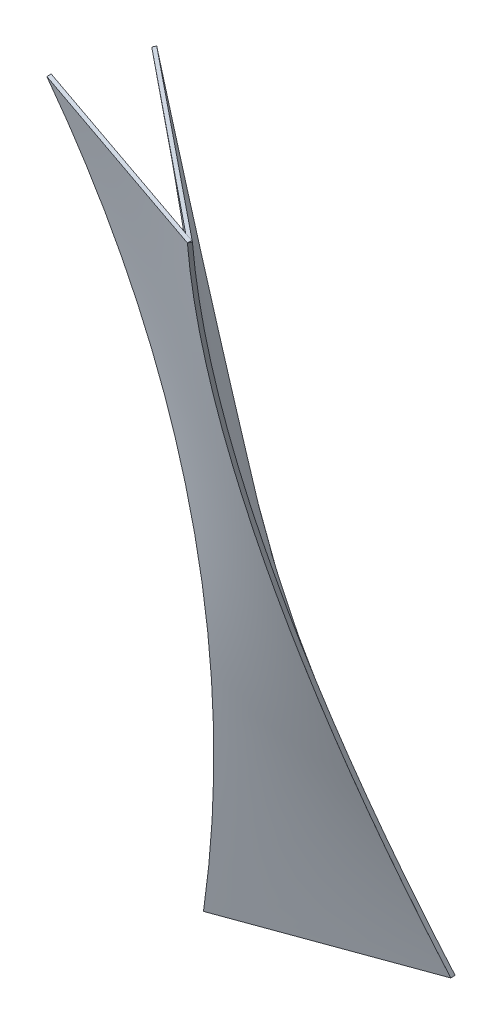
ISO-10303-21;
HEADER;
FILE_DESCRIPTION(('STEP AP214'),'2;1');
FILE_NAME('part.step','',(''),(''),'','','');
FILE_SCHEMA(('AUTOMOTIVE_DESIGN { 1 0 10303 214 1 1 1 1 }'));
ENDSEC;
DATA;
#1=APPLICATION_CONTEXT('core data for automotive mechanical design processes');
#2=APPLICATION_PROTOCOL_DEFINITION('international standard','automotive_design',2000,#1);
#3=PRODUCT_CONTEXT('',#1,'mechanical');
#4=PRODUCT('Part','Part','',(#3));
#5=PRODUCT_RELATED_PRODUCT_CATEGORY('part','',(#4));
#6=PRODUCT_DEFINITION_FORMATION('','',#4);
#7=PRODUCT_DEFINITION_CONTEXT('part definition',#1,'design');
#8=PRODUCT_DEFINITION('design','',#6,#7);
#9=PRODUCT_DEFINITION_SHAPE('','',#8);
#10=(LENGTH_UNIT() NAMED_UNIT(*) SI_UNIT(.MILLI.,.METRE.));
#11=(NAMED_UNIT(*) PLANE_ANGLE_UNIT() SI_UNIT($,.RADIAN.));
#12=(NAMED_UNIT(*) SI_UNIT($,.STERADIAN.) SOLID_ANGLE_UNIT());
#13=UNCERTAINTY_MEASURE_WITH_UNIT(LENGTH_MEASURE(1.E-05),#10,'distance_accuracy_value','');
#14=(GEOMETRIC_REPRESENTATION_CONTEXT(3) GLOBAL_UNCERTAINTY_ASSIGNED_CONTEXT((#13)) GLOBAL_UNIT_ASSIGNED_CONTEXT((#10,
#11,#12)) REPRESENTATION_CONTEXT('',''));
#15=CARTESIAN_POINT('',(0.,0.,0.));
#16=DIRECTION('',(0.,0.,1.));
#17=DIRECTION('',(1.,0.,0.));
#18=AXIS2_PLACEMENT_3D('',#15,#16,#17);
#19=CARTESIAN_POINT('',(405.75909064435,0.297613276226498,-1.76088398256517));
#20=CARTESIAN_POINT('',(400.241520559474,17.1568183574015,3.09678161683561));
#21=CARTESIAN_POINT('',(395.432784560058,34.1374896478223,8.11452307593297));
#22=CARTESIAN_POINT('',(387.249313277293,68.2617353514932,18.4396016530041));
#23=CARTESIAN_POINT('',(383.875146000932,85.4056859641132,23.7465504665426));
#24=CARTESIAN_POINT('',(378.579761477345,119.769967172286,34.6261164844415));
#25=CARTESIAN_POINT('',(376.660526360235,136.990029846162,40.199040067426));
#26=CARTESIAN_POINT('',(374.258068094689,171.407020368814,51.6016845724291));
#27=CARTESIAN_POINT('',(373.77247572022,188.602526525159,57.4330108976936));
#28=CARTESIAN_POINT('',(374.162587572088,222.887440447607,69.3229756779121));
#29=CARTESIAN_POINT('',(375.035993425639,239.978198714377,75.3796231425244));
#30=CARTESIAN_POINT('',(378.121638152952,273.997145496411,87.6682734905477));
#31=CARTESIAN_POINT('',(380.335942650813,290.925714665469,93.9003065631421));
#32=CARTESIAN_POINT('',(389.02498243923,341.362619693454,112.818026470025));
#33=CARTESIAN_POINT('',(397.552212716808,374.520817588298,125.728139330916));
#34=CARTESIAN_POINT('',(408.871387733421,406.893492684678,138.848063755967));
#35=CARTESIAN_POINT('',(406.4,-4.9960036108132E-13,-1.66533453693773E-13));
#36=CARTESIAN_POINT('',(400.875803743467,16.8301483507954,4.85516634711523));
#37=CARTESIAN_POINT('',(396.052387307723,33.7794215285061,9.87237164888313));
#38=CARTESIAN_POINT('',(387.806746521208,67.8365475096836,20.2033010112182));
#39=CARTESIAN_POINT('',(384.384522170436,84.9444003131504,25.5170250717854));
#40=CARTESIAN_POINT('',(378.94089799726,119.239015517767,36.4134328012135));
#41=CARTESIAN_POINT('',(376.919498174856,136.425777918917,41.9961164700744));
#42=CARTESIAN_POINT('',(374.277155501811,170.798542290827,53.4028842655842));
#43=CARTESIAN_POINT('',(373.656212651169,187.984544261587,59.2269683922331));
#44=CARTESIAN_POINT('',(373.814416365044,222.276117744644,71.0889779528133));
#45=CARTESIAN_POINT('',(374.59356292956,239.381689256941,77.1269033867446));
#46=CARTESIAN_POINT('',(377.551577917146,273.432731794998,89.3890364113839));
#47=CARTESIAN_POINT('',(379.730446340215,290.378202820758,95.6132440020919));
#48=CARTESIAN_POINT('',(388.366083062344,340.854960126126,114.523951283623));
#49=CARTESIAN_POINT('',(396.921882814326,374.026590633819,127.448535483852));
#50=CARTESIAN_POINT('',(408.274920943785,406.4,140.580329094601));
#51=B_SPLINE_SURFACE_WITH_KNOTS('',1,3,((#19,#20,#21,#22,#23,#24,#25,#26,#27,#28,#29,#30,#31,
#32,#33,#34),(#35,#36,#37,#38,#39,#40,#41,#42,#43,#44,#45,#46,#47,#48,#49,#50)),.UNSPECIFIED.,
.F.,.F.,.F.,(2,2),(4,2,2,2,2,2,2,4),(0.,1.),(0.,0.125,0.25,0.375,0.5,0.625,0.75,1.),.UNSPECIFIED.);
#52=CARTESIAN_POINT('',(408.274920943785,406.4,140.580329094601));
#53=CARTESIAN_POINT('',(408.871387733421,406.893492684678,138.848063755967));
#54=B_SPLINE_CURVE_WITH_KNOTS('',1,(#52,#53),.UNSPECIFIED.,.F.,.F.,(2,2),(0.,1.),.UNSPECIFIED.);
#55=CARTESIAN_POINT('',(408.274920943785,406.4,140.580329094601));
#56=VERTEX_POINT('',#55);
#57=CARTESIAN_POINT('',(408.871387733421,406.893492684678,138.848063755967));
#58=VERTEX_POINT('',#57);
#59=EDGE_CURVE('E16',#56,#58,#54,.T.);
#60=CARTESIAN_POINT('',(408.274920943785,406.4,140.580329094601));
#61=CARTESIAN_POINT('',(396.921882814326,374.026590633819,127.448535483852));
#62=CARTESIAN_POINT('',(388.366083062344,340.854960126126,114.523951283623));
#63=CARTESIAN_POINT('',(379.730446340215,290.378202820758,95.6132440020919));
#64=CARTESIAN_POINT('',(377.551577917146,273.432731794998,89.3890364113839));
#65=CARTESIAN_POINT('',(374.59356292956,239.381689256941,77.1269033867446));
#66=CARTESIAN_POINT('',(373.814416365044,222.276117744644,71.0889779528133));
#67=CARTESIAN_POINT('',(373.656212651169,187.984544261587,59.2269683922331));
#68=CARTESIAN_POINT('',(374.277155501811,170.798542290827,53.4028842655842));
#69=CARTESIAN_POINT('',(376.919498174856,136.425777918917,41.9961164700744));
#70=CARTESIAN_POINT('',(378.94089799726,119.239015517767,36.4134328012135));
#71=CARTESIAN_POINT('',(384.384522170436,84.9444003131504,25.5170250717854));
#72=CARTESIAN_POINT('',(387.806746521208,67.8365475096836,20.2033010112182));
#73=CARTESIAN_POINT('',(396.052387307723,33.7794215285061,9.87237164888313));
#74=CARTESIAN_POINT('',(400.875803743467,16.8301483507954,4.85516634711523));
#75=CARTESIAN_POINT('',(406.4,-4.9960036108132E-13,-1.66533453693773E-13));
#76=B_SPLINE_CURVE_WITH_KNOTS('',3,(#60,#61,#62,#63,#64,#65,#66,#67,#68,#69,#70,#71,#72,#73,#74,
#75),.UNSPECIFIED.,.F.,.F.,(4,2,2,2,2,2,2,4),(0.,0.25,0.375,0.5,0.625,0.75,0.875,1.),.UNSPECIFIED.);
#77=CARTESIAN_POINT('',(406.4,-4.9960036108132E-13,-1.66533453693773E-13));
#78=VERTEX_POINT('',#77);
#79=EDGE_CURVE('E405',#56,#78,#76,.T.);
#80=CARTESIAN_POINT('',(406.4,-4.9960036108132E-13,-1.66533453693773E-13));
#81=CARTESIAN_POINT('',(405.75909064435,0.297613276226498,-1.76088398256517));
#82=B_SPLINE_CURVE_WITH_KNOTS('',1,(#80,#81),.UNSPECIFIED.,.F.,.F.,(2,2),(0.,1.),.UNSPECIFIED.);
#83=CARTESIAN_POINT('',(405.759090578139,0.297613478537828,-1.76088392427293));
#84=VERTEX_POINT('',#83);
#85=EDGE_CURVE('E237',#78,#84,#82,.T.);
#86=CARTESIAN_POINT('',(408.871387733315,406.893492684598,138.848063755908));
#87=CARTESIAN_POINT('',(406.045848205385,398.813095987815,135.573202727086));
#88=CARTESIAN_POINT('',(403.389705421104,390.67042273589,132.306034139234));
#89=CARTESIAN_POINT('',(398.425538790637,374.296387754336,125.800699990263));
#90=CARTESIAN_POINT('',(396.116571015863,366.065334177512,122.562479158783));
#91=CARTESIAN_POINT('',(391.845369425491,349.524728598065,116.117960393329));
#92=CARTESIAN_POINT('',(389.882342452233,341.215403418482,112.911605769203));
#93=CARTESIAN_POINT('',(386.300791578708,324.52840543455,106.533498736455));
#94=CARTESIAN_POINT('',(384.681624716541,316.150891152633,103.361692458919));
#95=CARTESIAN_POINT('',(381.785061682531,299.337377164101,97.0553232485917));
#96=CARTESIAN_POINT('',(380.507171870474,290.901480237973,93.9207128588432));
#97=CARTESIAN_POINT('',(378.290075231257,273.980526093792,87.6916900416563));
#98=CARTESIAN_POINT('',(377.350523553427,265.495527938872,84.5972398007834));
#99=CARTESIAN_POINT('',(375.807562234965,248.48482381307,78.4524657053915));
#100=CARTESIAN_POINT('',(375.203955079866,239.959144740434,75.4021169517521));
#101=CARTESIAN_POINT('',(374.332720848214,222.874584485591,69.3510327638861));
#102=CARTESIAN_POINT('',(374.065040305884,214.315708804495,66.3502895095364));
#103=CARTESIAN_POINT('',(373.869998360882,197.172093697097,60.4049464353135));
#104=CARTESIAN_POINT('',(373.94272292845,188.587348284452,57.4603609867998));
#105=CARTESIAN_POINT('',(374.4370783613,171.400813394735,51.6327662780318));
#106=CARTESIAN_POINT('',(374.858930275162,162.799016564691,48.7497972165632));
#107=CARTESIAN_POINT('',(376.060255072011,145.589568886692,43.0481229564943));
#108=CARTESIAN_POINT('',(376.840079534277,136.981920609878,40.2294838023753));
#109=CARTESIAN_POINT('',(378.762033942599,119.773263083559,34.6574414294784));
#110=CARTESIAN_POINT('',(379.904640569555,111.172277578947,31.9041291922633));
#111=CARTESIAN_POINT('',(382.552460083721,93.9891428543165,26.4640317537778));
#112=CARTESIAN_POINT('',(384.058271030829,85.4070485086181,23.7773644230263));
#113=CARTESIAN_POINT('',(387.43042715973,68.2729491040625,18.4729809994736));
#114=CARTESIAN_POINT('',(389.297492223288,59.7210394326455,15.8554146436873));
#115=CARTESIAN_POINT('',(393.389497025632,42.657788869308,10.6925385988132));
#116=CARTESIAN_POINT('',(395.615282683121,34.1465940810645,8.1474168618365));
#117=CARTESIAN_POINT('',(400.422308014113,17.1747077081207,3.13313836619656));
#118=CARTESIAN_POINT('',(403.004525831254,8.71422435248241,0.664214348072064));
#119=CARTESIAN_POINT('',(405.759090577811,0.297613478361078,-1.76088392418329));
#120=B_SPLINE_CURVE_WITH_KNOTS('',3,(#86,#87,#88,#89,#90,#91,#92,#93,#94,#95,#96,#97,#98,#99,
#100,#101,#102,#103,#104,#105,#106,#107,#108,#109,#110,#111,#112,#113,#114,#115,#116,#117,#118,
#119),.UNSPECIFIED.,.F.,.F.,(4,2,2,2,2,2,2,2,2,2,2,2,2,2,2,2,4),(0.,27.4937762565962,
54.9113931492973,82.2653063009618,109.567612803358,136.830211324175,164.06494330005,
191.283645987988,218.498016022189,245.719259490679,272.957751177628,300.223052312495,
327.524328237375,354.870869654999,382.272477261826,409.73967389819,437.283804515912),.UNSPECIFIED.);
#121=EDGE_CURVE('E290',#58,#84,#120,.T.);
#122=ORIENTED_EDGE('',*,*,#59,.F.);
#123=ORIENTED_EDGE('',*,*,#79,.T.);
#124=ORIENTED_EDGE('',*,*,#85,.T.);
#125=ORIENTED_EDGE('',*,*,#121,.F.);
#126=EDGE_LOOP('',(#122,#123,#124,#125));
#127=FACE_BOUND('',#126,.T.);
#128=ADVANCED_FACE('F223',(#127),#51,.F.);
#129=CARTESIAN_POINT('',(405.75909064435,0.297613276226498,-1.76088398256517));
#130=CARTESIAN_POINT('',(373.934264302351,0.287127531838947,9.82063328359208));
#131=CARTESIAN_POINT('',(342.109473920611,0.276735720038767,21.4022493497388));
#132=CARTESIAN_POINT('',(310.28471771034,0.266439596706901,32.9839593012212));
#133=CARTESIAN_POINT('',(406.4,-4.9960036108132E-13,-1.6306400674182E-13));
#134=CARTESIAN_POINT('',(374.575743242717,-3.70074341541719E-13,11.583082187296));
#135=CARTESIAN_POINT('',(342.751486485434,-2.40548322002116E-13,23.1661643745923));
#136=CARTESIAN_POINT('',(310.927229728152,-1.11022302462516E-13,34.7492465618883));
#137=B_SPLINE_SURFACE_WITH_KNOTS('',1,3,((#129,#130,#131,#132),(#133,#134,#135,#136)),
.UNSPECIFIED.,.F.,.F.,.F.,(2,2),(4,4),(0.,1.),(-0.0508,0.0508),.UNSPECIFIED.);
#138=CARTESIAN_POINT('',(406.4,-4.9960036108132E-13,-1.6306400674182E-13));
#139=CARTESIAN_POINT('',(374.575743242717,-3.70074341541719E-13,11.583082187296));
#140=CARTESIAN_POINT('',(342.751486485434,-2.40548322002116E-13,23.1661643745923));
#141=CARTESIAN_POINT('',(310.927229728152,-1.11022302462516E-13,34.7492465618883));
#142=B_SPLINE_CURVE_WITH_KNOTS('',3,(#138,#139,#140,#141),.UNSPECIFIED.,.F.,.F.,(4,4),(-0.0508,
0.0508),.UNSPECIFIED.);
#143=CARTESIAN_POINT('',(310.927229728152,-1.11022302462516E-13,34.7492465618883));
#144=VERTEX_POINT('',#143);
#145=EDGE_CURVE('E273',#78,#144,#142,.T.);
#146=CARTESIAN_POINT('',(310.927229728152,-1.11022302462516E-13,34.7492465618883));
#147=CARTESIAN_POINT('',(310.28471771034,0.266439596706901,32.9839593012212));
#148=B_SPLINE_CURVE_WITH_KNOTS('',1,(#146,#147),.UNSPECIFIED.,.F.,.F.,(2,2),(0.,1.),.UNSPECIFIED.);
#149=CARTESIAN_POINT('',(310.28471771034,0.266439596706901,32.9839593012212));
#150=VERTEX_POINT('',#149);
#151=EDGE_CURVE('E267',#144,#150,#148,.T.);
#152=CARTESIAN_POINT('',(405.759090644376,0.297613276315761,-1.7608839825596));
#153=CARTESIAN_POINT('',(401.780987352119,0.296302558192445,-0.313194324470919));
#154=CARTESIAN_POINT('',(397.802884621263,0.294993307326997,1.13449687761774));
#155=CARTESIAN_POINT('',(389.84668027629,0.292377747476712,4.02988235017074));
#156=CARTESIAN_POINT('',(385.868578662174,0.291071438491875,5.47757662063508));
#157=CARTESIAN_POINT('',(377.912376543831,0.288461769767428,8.3729682106029));
#158=CARTESIAN_POINT('',(373.934276039604,0.287158410027817,9.82066553010638));
#159=CARTESIAN_POINT('',(365.978076133826,0.284554647010357,12.7160631990015));
#160=CARTESIAN_POINT('',(361.999976732274,0.283254243732507,14.1637635483931));
#161=CARTESIAN_POINT('',(354.043779025117,0.280656400575844,17.0591672577499));
#162=CARTESIAN_POINT('',(350.065680719511,0.279358960697031,18.506870617715));
#163=CARTESIAN_POINT('',(342.109485196855,0.276767050999518,21.4022803291675));
#164=CARTESIAN_POINT('',(338.131387979804,0.275472581180819,22.8499866806549));
#165=CARTESIAN_POINT('',(330.17519462764,0.27288661832581,25.7454023558877));
#166=CARTESIAN_POINT('',(326.197098492527,0.2715951252895,27.1931116796332));
#167=CARTESIAN_POINT('',(318.240907297248,0.269015122208934,30.088533280258));
#168=CARTESIAN_POINT('',(314.262812237082,0.267726612164678,31.5362455571373));
#169=CARTESIAN_POINT('',(310.284717710376,0.266439596721114,32.9839593012101));
#170=B_SPLINE_CURVE_WITH_KNOTS('',3,(#152,#153,#154,#155,#156,#157,#158,#159,#160,#161,#162,
#163,#164,#165,#166,#167,#168,#169),.UNSPECIFIED.,.F.,.F.,(4,2,2,2,2,2,2,2,4),(0.,
12.7000006225142,25.4000012419882,38.100001857906,50.8000024709633,63.5000030803236,
76.2000036872849,88.9000042907446,101.600004890798),.UNSPECIFIED.);
#171=EDGE_CURVE('E271',#84,#150,#170,.T.);
#172=ORIENTED_EDGE('',*,*,#85,.F.);
#173=ORIENTED_EDGE('',*,*,#145,.T.);
#174=ORIENTED_EDGE('',*,*,#151,.T.);
#175=ORIENTED_EDGE('',*,*,#171,.F.);
#176=EDGE_LOOP('',(#172,#173,#174,#175));
#177=FACE_BOUND('',#176,.T.);
#178=ADVANCED_FACE('F270',(#177),#137,.T.);
#179=CARTESIAN_POINT('',(310.28471771034,0.266439596706901,32.9839593012212));
#180=CARTESIAN_POINT('',(313.862472715234,17.3137889056314,34.2547656664772));
#181=CARTESIAN_POINT('',(316.917671453523,34.4174419801883,35.7241055825407));
#182=CARTESIAN_POINT('',(322.002450906987,68.685976543224,39.0473304880516));
#183=CARTESIAN_POINT('',(324.032542145917,85.8507540055796,40.9006304285395));
#184=CARTESIAN_POINT('',(327.092137221406,120.192857149516,44.9875385480987));
#185=CARTESIAN_POINT('',(328.124087997681,137.37043906088,47.2213261784873));
#186=CARTESIAN_POINT('',(329.176224351977,171.690787947088,52.0888951668697));
#187=CARTESIAN_POINT('',(329.193861018843,188.833743729539,54.7254108872067));
#188=CARTESIAN_POINT('',(328.134200704218,223.028945552092,60.3923598889158));
#189=CARTESIAN_POINT('',(327.053981057678,240.080840979114,63.4198325686615));
#190=CARTESIAN_POINT('',(323.776841651694,274.032678231739,69.8233407046145));
#191=CARTESIAN_POINT('',(321.582530464102,290.932539338996,73.199342680798));
#192=CARTESIAN_POINT('',(316.110315983243,324.522040180055,80.2881947303088));
#193=CARTESIAN_POINT('',(312.833024305126,341.211713072063,84.0017692985577));
#194=CARTESIAN_POINT('',(305.218585867865,374.325598042727,91.764745007646));
#195=CARTESIAN_POINT('',(300.881310340118,390.749887360145,95.8142546831722));
#196=CARTESIAN_POINT('',(296.020251499013,407.014542860501,100.029410642425));
#197=CARTESIAN_POINT('',(310.927229728152,-1.11022302462516E-13,34.7492465618883));
#198=CARTESIAN_POINT('',(314.500044493638,17.0481663924933,36.0219743518794));
#199=CARTESIAN_POINT('',(317.542829411383,34.1539538742641,37.496314137092));
#200=CARTESIAN_POINT('',(322.570397248323,68.4267896001062,40.8393211958802));
#201=CARTESIAN_POINT('',(324.555180167519,85.5938378441775,42.7079884694557));
#202=CARTESIAN_POINT('',(327.468801704298,119.935213678366,46.8307540028896));
#203=CARTESIAN_POINT('',(328.397640321881,137.109541268484,49.084852262748));
#204=CARTESIAN_POINT('',(329.20143095237,171.411494378511,53.9695832666675));
#205=CARTESIAN_POINT('',(329.076382965275,188.53911989842,56.6002160107287));
#206=CARTESIAN_POINT('',(327.774458083343,222.693687451776,62.2291194809737));
#207=CARTESIAN_POINT('',(326.597581188507,239.720629485223,65.2273902071575));
#208=CARTESIAN_POINT('',(323.194056188026,273.619848649401,71.5826731395678));
#209=CARTESIAN_POINT('',(320.967408082382,290.492125780131,74.9396853457943));
#210=CARTESIAN_POINT('',(315.466398357223,324.02803372262,82.0035547362097));
#211=CARTESIAN_POINT('',(312.192036737707,340.691664534379,85.7104119203987));
#212=CARTESIAN_POINT('',(304.59765768174,373.756298422672,93.4650747646591));
#213=CARTESIAN_POINT('',(300.277640245289,390.157301499206,97.5128804247306));
#214=CARTESIAN_POINT('',(295.435823748837,406.4,101.726712071703));
#215=B_SPLINE_SURFACE_WITH_KNOTS('',1,3,((#179,#180,#181,#182,#183,#184,#185,#186,#187,#188,
#189,#190,#191,#192,#193,#194,#195,#196),(#197,#198,#199,#200,#201,#202,#203,#204,#205,#206,
#207,#208,#209,#210,#211,#212,#213,#214)),.UNSPECIFIED.,.F.,.F.,.F.,(2,2),(4,2,2,2,2,2,2,2,4),
(0.,1.),(0.,0.125,0.25,0.375,0.5,0.625,0.75,0.875,1.),.UNSPECIFIED.);
#216=CARTESIAN_POINT('',(310.927229728152,-1.11022302462516E-13,34.7492465618883));
#217=CARTESIAN_POINT('',(314.500044493638,17.0481663924933,36.0219743518794));
#218=CARTESIAN_POINT('',(317.542829411383,34.1539538742641,37.496314137092));
#219=CARTESIAN_POINT('',(322.570397248323,68.4267896001062,40.8393211958802));
#220=CARTESIAN_POINT('',(324.555180167519,85.5938378441775,42.7079884694557));
#221=CARTESIAN_POINT('',(327.468801704298,119.935213678366,46.8307540028896));
#222=CARTESIAN_POINT('',(328.397640321881,137.109541268484,49.084852262748));
#223=CARTESIAN_POINT('',(329.20143095237,171.411494378511,53.9695832666675));
#224=CARTESIAN_POINT('',(329.076382965275,188.53911989842,56.6002160107287));
#225=CARTESIAN_POINT('',(327.774458083343,222.693687451776,62.2291194809737));
#226=CARTESIAN_POINT('',(326.597581188507,239.720629485223,65.2273902071575));
#227=CARTESIAN_POINT('',(323.194056188026,273.619848649401,71.5826731395678));
#228=CARTESIAN_POINT('',(320.967408082382,290.492125780131,74.9396853457943));
#229=CARTESIAN_POINT('',(315.466398357223,324.02803372262,82.0035547362097));
#230=CARTESIAN_POINT('',(312.192036737707,340.691664534379,85.7104119203987));
#231=CARTESIAN_POINT('',(304.59765768174,373.756298422672,93.4650747646591));
#232=CARTESIAN_POINT('',(300.277640245289,390.157301499206,97.5128804247306));
#233=CARTESIAN_POINT('',(295.435823748837,406.4,101.726712071703));
#234=B_SPLINE_CURVE_WITH_KNOTS('',3,(#216,#217,#218,#219,#220,#221,#222,#223,#224,#225,#226,
#227,#228,#229,#230,#231,#232,#233),.UNSPECIFIED.,.F.,.F.,(4,2,2,2,2,2,2,2,4),(0.,0.125,0.25,
0.375,0.5,0.625,0.75,0.875,1.),.UNSPECIFIED.);
#235=CARTESIAN_POINT('',(295.435823748837,406.4,101.726712071703));
#236=VERTEX_POINT('',#235);
#237=EDGE_CURVE('E292',#144,#236,#234,.T.);
#238=CARTESIAN_POINT('',(295.435823748837,406.4,101.726712071703));
#239=CARTESIAN_POINT('',(296.020251499013,407.014542860501,100.029410642425));
#240=B_SPLINE_CURVE_WITH_KNOTS('',1,(#238,#239),.UNSPECIFIED.,.F.,.F.,(2,2),(0.,1.),.UNSPECIFIED.);
#241=CARTESIAN_POINT('',(296.020251555439,407.014542860442,100.029410661833));
#242=VERTEX_POINT('',#241);
#243=EDGE_CURVE('E280',#236,#242,#240,.T.);
#244=CARTESIAN_POINT('',(310.284717710376,0.266439596721114,32.9839593012101));
#245=CARTESIAN_POINT('',(312.07194306075,8.78143522179147,33.6187100331291));
#246=CARTESIAN_POINT('',(313.730473874938,17.3196102959697,34.3037029522282));
#247=CARTESIAN_POINT('',(316.788181586326,34.4177538884283,35.7715602424645));
#248=CARTESIAN_POINT('',(318.187825321479,42.977654396586,36.5542440967377));
#249=CARTESIAN_POINT('',(320.730376585478,60.112821502199,38.2159368554479));
#250=CARTESIAN_POINT('',(321.873668471024,68.6880453996105,39.0947985727857));
#251=CARTESIAN_POINT('',(323.906853049997,85.8476679308843,40.947815606039));
#252=CARTESIAN_POINT('',(324.797047191414,94.4320433234997,41.9218556867024));
#253=CARTESIAN_POINT('',(326.326957892245,111.603999563329,43.9654126244469));
#254=CARTESIAN_POINT('',(326.966894451403,120.191570922212,45.0348446026935));
#255=CARTESIAN_POINT('',(327.996887351832,137.364032514666,47.2711497778484));
#256=CARTESIAN_POINT('',(328.387086307982,145.948921475199,48.4379669309409));
#257=CARTESIAN_POINT('',(328.913151676335,163.109879620922,50.8719103466354));
#258=CARTESIAN_POINT('',(329.049089953241,171.685950613304,52.1390081601593));
#259=CARTESIAN_POINT('',(329.056983968314,188.822546609654,54.7741850703855));
#260=CARTESIAN_POINT('',(328.928947215494,197.383072048896,56.1422612935963));
#261=CARTESIAN_POINT('',(328.399063362426,214.481267592475,58.9757829810547));
#262=CARTESIAN_POINT('',(327.997163404156,223.0189329652,60.4412471927593));
#263=CARTESIAN_POINT('',(326.914917196282,240.06384256142,63.4639048423183));
#264=CARTESIAN_POINT('',(326.234459926949,248.571073289861,65.0211346415039));
#265=CARTESIAN_POINT('',(324.595866128104,265.54759146511,68.2230091125799));
#266=CARTESIAN_POINT('',(323.637561469847,274.016852775824,69.8677062184497));
#267=CARTESIAN_POINT('',(321.446644508113,290.910085901798,73.2423754758963));
#268=CARTESIAN_POINT('',(320.213806627169,299.334014604933,74.9724168375338));
#269=CARTESIAN_POINT('',(317.477594106831,316.129438990041,78.5169933953948));
#270=CARTESIAN_POINT('',(315.973934811362,324.500869818731,80.3316159916771));
#271=CARTESIAN_POINT('',(312.699315441086,341.184341440328,84.0450360432112));
#272=CARTESIAN_POINT('',(310.928009213738,349.496290507708,85.9439402218598));
#273=CARTESIAN_POINT('',(307.120621747127,366.053976700596,89.825611422874));
#274=CARTESIAN_POINT('',(305.084130164878,374.299589736841,91.8085051324489));
#275=CARTESIAN_POINT('',(300.748200086485,390.717917815356,95.8575824057132));
#276=CARTESIAN_POINT('',(298.44828423428,398.890470635771,97.9239126369123));
#277=CARTESIAN_POINT('',(296.020251499218,407.014542860509,100.029410642498));
#278=B_SPLINE_CURVE_WITH_KNOTS('',3,(#244,#245,#246,#247,#248,#249,#250,#251,#252,#253,#254,
#255,#256,#257,#258,#259,#260,#261,#262,#263,#264,#265,#266,#267,#268,#269,#270,#271,#272,#273,
#274,#275,#276,#277),.UNSPECIFIED.,.F.,.F.,(4,2,2,2,2,2,2,2,2,2,2,2,2,2,2,2,4),(0.,
26.1697304581028,52.2918002349456,78.3744384774044,104.425880017848,130.454368152313,
156.467979193519,182.474236588371,208.47975422143,234.490292571699,260.511207596872,
286.547901165443,312.606067932714,338.691785584422,364.811533786324,390.972190470361,
417.181026644012),.UNSPECIFIED.);
#279=EDGE_CURVE('E288',#150,#242,#278,.T.);
#280=ORIENTED_EDGE('',*,*,#151,.F.);
#281=ORIENTED_EDGE('',*,*,#237,.T.);
#282=ORIENTED_EDGE('',*,*,#243,.T.);
#283=ORIENTED_EDGE('',*,*,#279,.F.);
#284=EDGE_LOOP('',(#280,#281,#282,#283));
#285=FACE_BOUND('',#284,.T.);
#286=ADVANCED_FACE('F297',(#285),#215,.T.);
#287=CARTESIAN_POINT('',(296.020251499013,407.014542860501,100.029410642425));
#288=CARTESIAN_POINT('',(333.637625602769,406.975588572539,112.968007085363));
#289=CARTESIAN_POINT('',(371.254698549075,406.935191245444,125.907478154047));
#290=CARTESIAN_POINT('',(408.871387733421,406.893492684678,138.848063755967));
#291=CARTESIAN_POINT('',(295.435823748837,406.4,101.726712071703));
#292=CARTESIAN_POINT('',(333.048856147153,406.4,114.677917746002));
#293=CARTESIAN_POINT('',(370.661888545469,406.4,127.629123420301));
#294=CARTESIAN_POINT('',(408.274920943785,406.4,140.580329094601));
#295=B_SPLINE_SURFACE_WITH_KNOTS('',1,3,((#287,#288,#289,#290),(#291,#292,#293,#294)),
.UNSPECIFIED.,.F.,.F.,.F.,(2,2),(4,4),(0.,1.),(-0.0596704814199049,0.0596704814199049),.UNSPECIFIED.);
#296=CARTESIAN_POINT('',(295.435823748837,406.4,101.726712071703));
#297=CARTESIAN_POINT('',(333.048856147153,406.4,114.677917746002));
#298=CARTESIAN_POINT('',(370.661888545469,406.4,127.629123420301));
#299=CARTESIAN_POINT('',(408.274920943785,406.4,140.580329094601));
#300=B_SPLINE_CURVE_WITH_KNOTS('',3,(#296,#297,#298,#299),.UNSPECIFIED.,.F.,.F.,(4,4),
(-0.0596704814199049,0.0596704814199049),.UNSPECIFIED.);
#301=EDGE_CURVE('E399',#236,#56,#300,.T.);
#302=CARTESIAN_POINT('',(296.020251499218,407.014542860509,100.029410642498));
#303=CARTESIAN_POINT('',(300.72242327837,407.009673581212,101.646735203735));
#304=CARTESIAN_POINT('',(305.424590337063,407.00478184277,103.26407342151));
#305=CARTESIAN_POINT('',(314.828914722113,406.994953898393,106.498778121924));
#306=CARTESIAN_POINT('',(319.531072048468,406.990017692456,108.116144604563));
#307=CARTESIAN_POINT('',(328.935376644793,406.980101263917,111.35090677527));
#308=CARTESIAN_POINT('',(333.637523914763,406.975121041313,112.968302463337));
#309=CARTESIAN_POINT('',(343.041808074679,406.965117077603,116.203123986168));
#310=CARTESIAN_POINT('',(347.743944964625,406.960093336496,117.820549820931));
#311=CARTESIAN_POINT('',(357.148208040354,406.950002869045,121.055432577072));
#312=CARTESIAN_POINT('',(361.850334226136,406.944936142701,122.67288949845));
#313=CARTESIAN_POINT('',(371.254575570578,406.934760278582,125.907835365791));
#314=CARTESIAN_POINT('',(375.956690729238,406.929651140806,127.525324311754));
#315=CARTESIAN_POINT('',(385.360909697996,406.919391062323,130.760335163043));
#316=CARTESIAN_POINT('',(390.063013508094,406.914240121616,132.377857068369));
#317=CARTESIAN_POINT('',(399.467209459653,406.903897096284,135.612934766781));
#318=CARTESIAN_POINT('',(404.169301601114,406.898705011658,137.230490559868));
#319=CARTESIAN_POINT('',(408.871387733315,406.893492684598,138.848063755908));
#320=B_SPLINE_CURVE_WITH_KNOTS('',3,(#302,#303,#304,#305,#306,#307,#308,#309,#310,#311,#312,
#313,#314,#315,#316,#317,#318,#319),.UNSPECIFIED.,.F.,.F.,(4,2,2,2,2,2,2,2,4),(0.,
14.9176283966375,29.8352568956717,44.7528854959958,59.670514198233,74.5881430001708,
89.5057719009458,104.423400900795,119.341029997457),.UNSPECIFIED.);
#321=EDGE_CURVE('E300',#242,#58,#320,.T.);
#322=ORIENTED_EDGE('',*,*,#301,.T.);
#323=ORIENTED_EDGE('',*,*,#59,.T.);
#324=ORIENTED_EDGE('',*,*,#321,.F.);
#325=ORIENTED_EDGE('',*,*,#243,.F.);
#326=EDGE_LOOP('',(#322,#323,#324,#325));
#327=FACE_BOUND('',#326,.T.);
#328=ADVANCED_FACE('F225',(#327),#295,.T.);
#329=CARTESIAN_POINT('',(310.927229728152,-1.11022302462516E-13,34.7492465618883));
#330=CARTESIAN_POINT('',(406.4,-4.9960036108132E-13,-1.66533453693773E-13));
#331=CARTESIAN_POINT('',(339.509747852042,136.385331139947,44.9310688818171));
#332=CARTESIAN_POINT('',(362.206429947739,134.641186806367,38.8413307769231));
#333=CARTESIAN_POINT('',(334.170355720453,276.458411993649,68.0160588959222));
#334=CARTESIAN_POINT('',(362.862768425951,276.906362535274,88.0531546516055));
#335=CARTESIAN_POINT('',(295.435823748837,406.4,101.726712071703));
#336=CARTESIAN_POINT('',(408.274920943785,406.4,140.580329094601));
#337=B_SPLINE_SURFACE_WITH_KNOTS('',3,1,((#329,#330),(#331,#332),(#333,#334),(#335,#336)),
.UNSPECIFIED.,.F.,.F.,.F.,(4,4),(2,2),(0.,1.),(0.,1.),.UNSPECIFIED.);
#338=OFFSET_SURFACE('',#337,1.89738,.F.);
#339=ORIENTED_EDGE('',*,*,#279,.T.);
#340=ORIENTED_EDGE('',*,*,#321,.T.);
#341=ORIENTED_EDGE('',*,*,#121,.T.);
#342=ORIENTED_EDGE('',*,*,#171,.T.);
#343=EDGE_LOOP('',(#339,#340,#341,#342));
#344=FACE_BOUND('',#343,.T.);
#345=ADVANCED_FACE('F286',(#344),#338,.T.);
#346=CARTESIAN_POINT('',(310.927229728152,-1.11022302462516E-13,34.7492465618883));
#347=CARTESIAN_POINT('',(406.4,-4.9960036108132E-13,-1.66533453693773E-13));
#348=CARTESIAN_POINT('',(339.509747852042,136.385331139947,44.9310688818171));
#349=CARTESIAN_POINT('',(362.206429947739,134.641186806367,38.8413307769231));
#350=CARTESIAN_POINT('',(334.170355720453,276.458411993649,68.0160588959222));
#351=CARTESIAN_POINT('',(362.862768425951,276.906362535274,88.0531546516055));
#352=CARTESIAN_POINT('',(295.435823748837,406.4,101.726712071703));
#353=CARTESIAN_POINT('',(408.274920943785,406.4,140.580329094601));
#354=B_SPLINE_SURFACE_WITH_KNOTS('',3,1,((#346,#347),(#348,#349),(#350,#351),(#352,#353)),
.UNSPECIFIED.,.F.,.F.,.F.,(4,4),(2,2),(0.,1.),(0.,1.),.UNSPECIFIED.);
#355=ORIENTED_EDGE('',*,*,#237,.F.);
#356=ORIENTED_EDGE('',*,*,#145,.F.);
#357=ORIENTED_EDGE('',*,*,#79,.F.);
#358=ORIENTED_EDGE('',*,*,#301,.F.);
#359=EDGE_LOOP('',(#355,#356,#357,#358));
#360=FACE_BOUND('',#359,.T.);
#361=ADVANCED_FACE('F395',(#360),#354,.F.);
#362=CLOSED_SHELL('',(#128,#178,#286,#328,#345,#361));
#363=MANIFOLD_SOLID_BREP('B2',#362);
#364=CARTESIAN_POINT('',(310.754589242113,406.717670194331,59.2029118259999));
#365=CARTESIAN_POINT('',(314.325108181927,372.264515501227,54.5655188691351));
#366=CARTESIAN_POINT('',(317.034760596931,337.874926002735,49.0847128332925));
#367=CARTESIAN_POINT('',(319.780337598839,286.484512817419,39.5948085358353));
#368=CARTESIAN_POINT('',(320.475398977889,269.386794990119,36.2197112899206));
#369=CARTESIAN_POINT('',(321.419259095742,235.273762988796,29.0457695325067));
#370=CARTESIAN_POINT('',(321.667832784726,218.258526746668,25.2467392173267));
#371=CARTESIAN_POINT('',(321.74091444658,167.361804892971,13.2235008246885));
#372=CARTESIAN_POINT('',(320.889096678212,133.630371054885,4.37473603940777));
#373=CARTESIAN_POINT('',(318.332108396528,83.4110149096875,-10.0667380572622));
#374=CARTESIAN_POINT('',(317.267484737467,66.7339486837487,-15.0757364421464));
#375=CARTESIAN_POINT('',(314.721886658995,33.5184515048803,-25.4801396046633));
#376=CARTESIAN_POINT('',(313.240793967951,16.980040107721,-30.8757294887628));
#377=CARTESIAN_POINT('',(311.551497903023,0.518224829833898,-36.4644092760314));
#378=CARTESIAN_POINT('',(309.57738383875,406.400000000001,60.6566394312709));
#379=CARTESIAN_POINT('',(313.120482702862,371.942376473648,55.9960656004373));
#380=CARTESIAN_POINT('',(315.806196191685,337.551940093272,50.4941023133153));
#381=CARTESIAN_POINT('',(318.548387366687,286.157687319235,41.0003472734812));
#382=CARTESIAN_POINT('',(319.248054581982,269.058170027311,37.6289605753447));
#383=CARTESIAN_POINT('',(320.218545827279,234.938039555232,30.4761294885683));
#384=CARTESIAN_POINT('',(320.48936985728,217.917426375078,26.6946850999285));
#385=CARTESIAN_POINT('',(320.658501920519,166.99659827166,14.7405839170744));
#386=CARTESIAN_POINT('',(319.913469926992,133.237394785442,5.95815910592562));
#387=CARTESIAN_POINT('',(317.508940887872,82.9712335077701,-8.41374006938472));
#388=CARTESIAN_POINT('',(316.492934366694,66.2779537404884,-13.4040834542527));
#389=CARTESIAN_POINT('',(314.031877475513,33.0307123694035,-23.7806451976374));
#390=CARTESIAN_POINT('',(312.58682710551,16.4767507656004,-29.1668635561541));
#391=CARTESIAN_POINT('',(310.927229728152,1.11022302462516E-13,-34.7492465618884));
#392=B_SPLINE_SURFACE_WITH_KNOTS('',1,3,((#364,#365,#366,#367,#368,#369,#370,#371,#372,#373,
#374,#375,#376,#377),(#378,#379,#380,#381,#382,#383,#384,#385,#386,#387,#388,#389,#390,#391)),
.UNSPECIFIED.,.F.,.F.,.F.,(2,2),(4,2,2,2,2,2,4),(0.,1.),(0.,0.25,0.375,0.5,0.75,0.875,1.),.UNSPECIFIED.);
#393=CARTESIAN_POINT('',(310.927229728152,1.11022302462516E-13,-34.7492465618884));
#394=CARTESIAN_POINT('',(311.551497903023,0.518224829833898,-36.4644092760314));
#395=B_SPLINE_CURVE_WITH_KNOTS('',1,(#393,#394),.UNSPECIFIED.,.F.,.F.,(2,2),(0.,1.),.UNSPECIFIED.);
#396=CARTESIAN_POINT('',(310.927229728152,1.11022302462516E-13,-34.7492465618884));
#397=VERTEX_POINT('',#396);
#398=CARTESIAN_POINT('',(311.551497903023,0.518224829833898,-36.4644092760314));
#399=VERTEX_POINT('',#398);
#400=EDGE_CURVE('E221',#397,#399,#395,.T.);
#401=CARTESIAN_POINT('',(310.927229728152,1.11022302462516E-13,-34.7492465618884));
#402=CARTESIAN_POINT('',(312.58682710551,16.4767507656004,-29.1668635561541));
#403=CARTESIAN_POINT('',(314.031877475513,33.0307123694035,-23.7806451976374));
#404=CARTESIAN_POINT('',(316.492934366694,66.2779537404884,-13.4040834542527));
#405=CARTESIAN_POINT('',(317.508940887872,82.9712335077701,-8.41374006938472));
#406=CARTESIAN_POINT('',(319.913469926992,133.237394785442,5.95815910592562));
#407=CARTESIAN_POINT('',(320.658501920519,166.99659827166,14.7405839170744));
#408=CARTESIAN_POINT('',(320.48936985728,217.917426375078,26.6946850999285));
#409=CARTESIAN_POINT('',(320.218545827279,234.938039555232,30.4761294885683));
#410=CARTESIAN_POINT('',(319.248054581982,269.058170027311,37.6289605753447));
#411=CARTESIAN_POINT('',(318.548387366687,286.157687319235,41.0003472734812));
#412=CARTESIAN_POINT('',(315.806196191685,337.551940093272,50.4941023133153));
#413=CARTESIAN_POINT('',(313.120482702862,371.942376473648,55.9960656004373));
#414=CARTESIAN_POINT('',(309.57738383875,406.400000000001,60.6566394312709));
#415=B_SPLINE_CURVE_WITH_KNOTS('',3,(#401,#402,#403,#404,#405,#406,#407,#408,#409,#410,#411,
#412,#413,#414),.UNSPECIFIED.,.F.,.F.,(4,2,2,2,2,2,4),(0.,0.125,0.25,0.5,0.625,0.75,1.),.UNSPECIFIED.);
#416=CARTESIAN_POINT('',(309.57738383875,406.400000000001,60.6566394312709));
#417=VERTEX_POINT('',#416);
#418=EDGE_CURVE('E850',#397,#417,#415,.T.);
#419=CARTESIAN_POINT('',(309.57738383875,406.400000000001,60.6566394312709));
#420=CARTESIAN_POINT('',(310.754589242113,406.717670194331,59.2029118259999));
#421=B_SPLINE_CURVE_WITH_KNOTS('',1,(#419,#420),.UNSPECIFIED.,.F.,.F.,(2,2),(0.,1.),.UNSPECIFIED.);
#422=CARTESIAN_POINT('',(310.754589242113,406.717670194331,59.2029118259999));
#423=VERTEX_POINT('',#422);
#424=EDGE_CURVE('E682',#417,#423,#421,.T.);
#425=CARTESIAN_POINT('',(311.551497902993,0.518224829791771,-36.4644092760553));
#426=CARTESIAN_POINT('',(312.395864883999,8.74697172513387,-33.6708059864156));
#427=CARTESIAN_POINT('',(313.188496605735,16.9971288171977,-30.9246829979168));
#428=CARTESIAN_POINT('',(314.669617062611,33.5339401806609,-25.5290975789819));
#429=CARTESIAN_POINT('',(315.358154983276,41.8205752988561,-22.8795899485797));
#430=CARTESIAN_POINT('',(316.630966554252,58.4285646666415,-17.6773073298695));
#431=CARTESIAN_POINT('',(317.215281025533,66.7499040110472,-15.1244947791472));
#432=CARTESIAN_POINT('',(318.278884091543,83.4254870588791,-10.1159546089365));
#433=CARTESIAN_POINT('',(318.758205440523,91.7797196704387,-7.66019690816614));
#434=CARTESIAN_POINT('',(320.036602537127,116.887068581665,-0.440040903398873));
#435=CARTESIAN_POINT('',(320.676560852179,133.690681476249,4.17907142003704));
#436=CARTESIAN_POINT('',(321.516474441453,167.410824025011,13.0146877224906));
#437=CARTESIAN_POINT('',(321.716511636042,184.327332067709,17.2312665197866));
#438=CARTESIAN_POINT('',(321.667873254322,218.259820480887,25.2470142176709));
#439=CARTESIAN_POINT('',(321.419164696954,235.275808071107,29.0461524162335));
#440=CARTESIAN_POINT('',(320.475341216519,269.390249730776,36.2204850296095));
#441=CARTESIAN_POINT('',(319.780082359651,286.488728624872,39.5955423335198));
#442=CARTESIAN_POINT('',(317.949679001264,320.750477520351,45.9225067250279));
#443=CARTESIAN_POINT('',(316.814280317352,337.913779275148,48.8741679478878));
#444=CARTESIAN_POINT('',(314.108962756492,372.288559898204,54.3556837922679));
#445=CARTESIAN_POINT('',(312.538675229942,389.500067322132,56.8851776195395));
#446=CARTESIAN_POINT('',(310.754589242023,406.717670194453,59.2029118259536));
#447=B_SPLINE_CURVE_WITH_KNOTS('',3,(#425,#426,#427,#428,#429,#430,#431,#432,#433,#434,#435,
#436,#437,#438,#439,#440,#441,#442,#443,#444,#445,#446),.UNSPECIFIED.,.F.,.F.,(4,2,2,2,2,2,2,2,
2,2,4),(0.,26.1925033092394,52.372591413855,78.5424029970838,104.704038833009,157.008893616638,
209.304007572614,261.602965171839,313.918788436548,366.264869401915,418.65545999644),.UNSPECIFIED.);
#448=EDGE_CURVE('E735',#399,#423,#447,.T.);
#449=ORIENTED_EDGE('',*,*,#400,.F.);
#450=ORIENTED_EDGE('',*,*,#418,.T.);
#451=ORIENTED_EDGE('',*,*,#424,.T.);
#452=ORIENTED_EDGE('',*,*,#448,.F.);
#453=EDGE_LOOP('',(#449,#450,#451,#452));
#454=FACE_BOUND('',#453,.T.);
#455=ADVANCED_FACE('F668',(#454),#392,.F.);
#456=CARTESIAN_POINT('',(310.754589242113,406.717670194331,59.2029118259999));
#457=CARTESIAN_POINT('',(343.658349389531,406.674805149674,85.8384845075997));
#458=CARTESIAN_POINT('',(376.561525865711,406.6285902971,112.474777966037));
#459=CARTESIAN_POINT('',(409.46368009462,406.578584319191,139.112333799429));
#460=CARTESIAN_POINT('',(309.57738383875,406.400000000001,60.6566394312709));
#461=CARTESIAN_POINT('',(342.476562873762,406.400000000001,87.2978693190474));
#462=CARTESIAN_POINT('',(375.375741908773,406.4,113.939099206824));
#463=CARTESIAN_POINT('',(408.274920943785,406.4,140.580329094601));
#464=B_SPLINE_SURFACE_WITH_KNOTS('',1,3,((#456,#457,#458,#459),(#460,#461,#462,#463)),
.UNSPECIFIED.,.F.,.F.,.F.,(2,2),(4,4),(0.,1.),(-0.0634999999999998,0.0634999999999998),.UNSPECIFIED.);
#465=CARTESIAN_POINT('',(309.57738383875,406.400000000001,60.6566394312709));
#466=CARTESIAN_POINT('',(342.476562873762,406.400000000001,87.2978693190474));
#467=CARTESIAN_POINT('',(375.375741908773,406.4,113.939099206824));
#468=CARTESIAN_POINT('',(408.274920943785,406.4,140.580329094601));
#469=B_SPLINE_CURVE_WITH_KNOTS('',3,(#465,#466,#467,#468),.UNSPECIFIED.,.F.,.F.,(4,4),
(-0.0634999999999998,0.0634999999999998),.UNSPECIFIED.);
#470=CARTESIAN_POINT('',(408.274920943785,406.4,140.580329094601));
#471=VERTEX_POINT('',#470);
#472=EDGE_CURVE('E718',#417,#471,#469,.T.);
#473=CARTESIAN_POINT('',(408.274920943785,406.4,140.580329094601));
#474=CARTESIAN_POINT('',(409.46368009462,406.578584319191,139.112333799429));
#475=B_SPLINE_CURVE_WITH_KNOTS('',1,(#473,#474),.UNSPECIFIED.,.F.,.F.,(2,2),(0.,1.),.UNSPECIFIED.);
#476=CARTESIAN_POINT('',(409.46368009462,406.578584319191,139.112333799429));
#477=VERTEX_POINT('',#476);
#478=EDGE_CURVE('E712',#471,#477,#475,.T.);
#479=CARTESIAN_POINT('',(310.754589242023,406.717670194453,59.2029118259536));
#480=CARTESIAN_POINT('',(314.867559287461,406.712312067711,62.5323584592184));
#481=CARTESIAN_POINT('',(318.980519996147,406.706901692999,65.8618165424716));
#482=CARTESIAN_POINT('',(327.206421311513,406.695974621653,72.5207575328658));
#483=CARTESIAN_POINT('',(331.319361918194,406.690457925018,75.8502404400072));
#484=CARTESIAN_POINT('',(339.545221522949,406.679316383943,82.5092329388694));
#485=CARTESIAN_POINT('',(343.658140521024,406.673691539502,85.8387425305907));
#486=CARTESIAN_POINT('',(351.883955308716,406.662331911992,92.4977903739677));
#487=CARTESIAN_POINT('',(355.996851098333,406.656597128921,95.827328625624));
#488=CARTESIAN_POINT('',(364.222617799246,406.645015866269,102.486435851074));
#489=CARTESIAN_POINT('',(368.335488710543,406.639169386685,105.816004824869));
#490=CARTESIAN_POINT('',(376.561203904072,406.627363018176,112.475175656572));
#491=CARTESIAN_POINT('',(380.674048186305,406.621403129249,115.804777514481));
#492=CARTESIAN_POINT('',(388.89970829783,406.609368274324,122.464016367092));
#493=CARTESIAN_POINT('',(393.012524127123,406.603293308323,125.793653361795));
#494=CARTESIAN_POINT('',(401.238125404566,406.591026710423,132.452964868448));
#495=CARTESIAN_POINT('',(405.350910852715,406.584835078521,135.782639380399));
#496=CARTESIAN_POINT('',(409.46368009444,406.578584319335,139.112333799301));
#497=B_SPLINE_CURVE_WITH_KNOTS('',3,(#479,#480,#481,#482,#483,#484,#485,#486,#487,#488,#489,
#490,#491,#492,#493,#494,#495,#496),.UNSPECIFIED.,.F.,.F.,(4,2,2,2,2,2,2,2,4),(0.,
15.8750085255193,31.7500173644289,47.6250265286796,63.5000360297126,79.3750458800092,
95.2500560921798,111.125066679862,127.000077655061),.UNSPECIFIED.);
#498=EDGE_CURVE('E716',#423,#477,#497,.T.);
#499=ORIENTED_EDGE('',*,*,#424,.F.);
#500=ORIENTED_EDGE('',*,*,#472,.T.);
#501=ORIENTED_EDGE('',*,*,#478,.T.);
#502=ORIENTED_EDGE('',*,*,#498,.F.);
#503=EDGE_LOOP('',(#499,#500,#501,#502));
#504=FACE_BOUND('',#503,.T.);
#505=ADVANCED_FACE('F715',(#504),#464,.T.);
#506=CARTESIAN_POINT('',(409.46368009462,406.578584319191,139.112333799429));
#507=CARTESIAN_POINT('',(398.138202240263,374.243373578937,126.007504992289));
#508=CARTESIAN_POINT('',(389.60347566529,341.117064949004,113.108583440776));
#509=CARTESIAN_POINT('',(380.959970422843,290.722032733382,94.2093686335626));
#510=CARTESIAN_POINT('',(378.771641677256,273.806112777454,87.9842521739134));
#511=CARTESIAN_POINT('',(375.776403755735,239.816408058308,75.7079971762034));
#512=CARTESIAN_POINT('',(374.969299421957,222.742586718958,69.6567529175643));
#513=CARTESIAN_POINT('',(374.622098975477,171.395280089517,51.8098288063173));
#514=CARTESIAN_POINT('',(377.154880458835,136.992743974414,40.3226479897945));
#515=CARTESIAN_POINT('',(387.847541565731,68.4603905342762,18.4493794646309));
#516=CARTESIAN_POINT('',(396.011912856473,34.3338969966266,8.06303091122408));
#517=CARTESIAN_POINT('',(407.005944911856,0.679158390803885,-1.66481996275768));
#518=CARTESIAN_POINT('',(408.274920943785,406.4,140.580329094601));
#519=CARTESIAN_POINT('',(396.921882814326,374.026590633819,127.448535483852));
#520=CARTESIAN_POINT('',(388.366083062344,340.854960126126,114.523951283623));
#521=CARTESIAN_POINT('',(379.730446340215,290.378202820758,95.6132440020919));
#522=CARTESIAN_POINT('',(377.551577917146,273.432731794998,89.3890364113839));
#523=CARTESIAN_POINT('',(374.59356292956,239.381689256941,77.1269033867446));
#524=CARTESIAN_POINT('',(373.814416365044,222.276117744644,71.0889779528133));
#525=CARTESIAN_POINT('',(373.577110794232,170.838757520059,53.295963611943));
#526=CARTESIAN_POINT('',(376.219085910672,136.386323120076,41.8616366659276));
#527=CARTESIAN_POINT('',(387.106334257024,67.797092710842,20.0688212070714));
#528=CARTESIAN_POINT('',(395.351607486935,33.6602967015914,9.71033269423063));
#529=CARTESIAN_POINT('',(406.4,-4.9960036108132E-13,-1.66533453693773E-13));
#530=B_SPLINE_SURFACE_WITH_KNOTS('',1,3,((#506,#507,#508,#509,#510,#511,#512,#513,#514,#515,
#516,#517),(#518,#519,#520,#521,#522,#523,#524,#525,#526,#527,#528,#529)),.UNSPECIFIED.,.F.,.F.,
.F.,(2,2),(4,2,2,2,2,4),(0.,1.),(0.,0.25,0.375,0.5,0.75,1.),.UNSPECIFIED.);
#531=CARTESIAN_POINT('',(408.274920943785,406.4,140.580329094601));
#532=CARTESIAN_POINT('',(396.921882814326,374.026590633819,127.448535483852));
#533=CARTESIAN_POINT('',(388.366083062344,340.854960126126,114.523951283623));
#534=CARTESIAN_POINT('',(379.730446340215,290.378202820758,95.6132440020919));
#535=CARTESIAN_POINT('',(377.551577917146,273.432731794998,89.3890364113839));
#536=CARTESIAN_POINT('',(374.59356292956,239.381689256941,77.1269033867446));
#537=CARTESIAN_POINT('',(373.814416365044,222.276117744644,71.0889779528133));
#538=CARTESIAN_POINT('',(373.577110794232,170.838757520059,53.295963611943));
#539=CARTESIAN_POINT('',(376.219085910672,136.386323120076,41.8616366659276));
#540=CARTESIAN_POINT('',(387.106334257024,67.797092710842,20.0688212070714));
#541=CARTESIAN_POINT('',(395.351607486935,33.6602967015914,9.71033269423063));
#542=CARTESIAN_POINT('',(406.4,-4.9960036108132E-13,-1.66533453693773E-13));
#543=B_SPLINE_CURVE_WITH_KNOTS('',3,(#531,#532,#533,#534,#535,#536,#537,#538,#539,#540,#541,
#542),.UNSPECIFIED.,.F.,.F.,(4,2,2,2,2,4),(0.,0.25,0.375,0.5,0.75,1.),.UNSPECIFIED.);
#544=CARTESIAN_POINT('',(406.4,-4.9960036108132E-13,-1.66533453693773E-13));
#545=VERTEX_POINT('',#544);
#546=EDGE_CURVE('E737',#471,#545,#543,.T.);
#547=CARTESIAN_POINT('',(406.4,-4.9960036108132E-13,-1.66533453693773E-13));
#548=CARTESIAN_POINT('',(407.005944911856,0.679158390803885,-1.66481996275768));
#549=B_SPLINE_CURVE_WITH_KNOTS('',1,(#547,#548),.UNSPECIFIED.,.F.,.F.,(2,2),(0.,1.),.UNSPECIFIED.);
#550=CARTESIAN_POINT('',(407.005944911856,0.679158390803885,-1.66481996275768));
#551=VERTEX_POINT('',#550);
#552=EDGE_CURVE('E725',#545,#551,#549,.T.);
#553=CARTESIAN_POINT('',(409.46368009444,406.578584319335,139.112333799301));
#554=CARTESIAN_POINT('',(406.636540629184,398.507276141108,135.841149833791));
#555=CARTESIAN_POINT('',(403.978933182747,390.373561533376,132.577516958155));
#556=CARTESIAN_POINT('',(399.012925896988,374.01691901701,126.078961629438));
#557=CARTESIAN_POINT('',(396.703583727882,365.794298800052,122.843984836283));
#558=CARTESIAN_POINT('',(392.433586918658,349.269981116359,116.405737128796));
#559=CARTESIAN_POINT('',(390.472136404162,340.96851114054,113.202410100928));
#560=CARTESIAN_POINT('',(386.897115105075,324.296618585571,106.830333653163));
#561=CARTESIAN_POINT('',(385.282892177992,315.926356468828,103.661530214955));
#562=CARTESIAN_POINT('',(382.401524671886,299.126869366269,97.3613609427456));
#563=CARTESIAN_POINT('',(381.133868675118,290.697750292384,94.2299465373571));
#564=CARTESIAN_POINT('',(378.944862822985,273.790365442686,88.0075083850345));
#565=CARTESIAN_POINT('',(378.023139788129,265.312162703994,84.916444605312));
#566=CARTESIAN_POINT('',(376.525420265603,248.31619799572,78.7779139620497));
#567=CARTESIAN_POINT('',(375.949186709212,239.798467203233,75.730418607502));
#568=CARTESIAN_POINT('',(375.142244774286,222.732800034913,69.682630257969));
#569=CARTESIAN_POINT('',(374.911433713437,214.184873392938,66.6823234979498));
#570=CARTESIAN_POINT('',(374.795693073766,197.068009036956,60.7329711196313));
#571=CARTESIAN_POINT('',(374.910793940205,188.499069539836,57.7839300364306));
#572=CARTESIAN_POINT('',(375.487852288286,171.349379543678,51.9415131990189));
#573=CARTESIAN_POINT('',(375.949972673267,162.768625387366,49.0481642431401));
#574=CARTESIAN_POINT('',(377.22251856328,145.604710211997,43.321629953142));
#575=CARTESIAN_POINT('',(378.033239424995,137.021553333787,40.488497779484));
#576=CARTESIAN_POINT('',(380.004573847381,119.862572833979,34.8867156945139));
#577=CARTESIAN_POINT('',(381.165615826529,111.286771158662,32.1181492341521));
#578=CARTESIAN_POINT('',(383.838956909015,94.1525788353871,26.6494786562004));
#579=CARTESIAN_POINT('',(385.351818631785,85.5942384621232,23.9494919627627));
#580=CARTESIAN_POINT('',(388.729683737002,68.5052688906943,18.6216125624334));
#581=CARTESIAN_POINT('',(390.595385577522,59.9747293887313,15.9938748976419));
#582=CARTESIAN_POINT('',(394.679370341563,42.9517616392312,10.8138886388581));
#583=CARTESIAN_POINT('',(396.898490020181,34.4594742954292,8.26183668953617));
#584=CARTESIAN_POINT('',(401.689102102651,17.5233233620798,3.23642570676711));
#585=CARTESIAN_POINT('',(404.261571982261,9.07966426759642,0.763309274560269));
#586=CARTESIAN_POINT('',(407.005944912005,0.67915839080613,-1.66481996270237));
#587=B_SPLINE_CURVE_WITH_KNOTS('',3,(#553,#554,#555,#556,#557,#558,#559,#560,#561,#562,#563,
#564,#565,#566,#567,#568,#569,#570,#571,#572,#573,#574,#575,#576,#577,#578,#579,#580,#581,#582,
#583,#584,#585,#586),.UNSPECIFIED.,.F.,.F.,(4,2,2,2,2,2,2,2,2,2,2,2,2,2,2,2,4),(0.,
27.4673249171479,54.8589417120941,82.1870627077315,109.463400604797,136.699267715278,
163.905668762998,191.09337983403,218.273007320386,245.455027077814,272.64981502789,
299.867689688693,327.118985771404,354.414164674555,381.763951775456,409.179482389254,
436.672440318948),.UNSPECIFIED.);
#588=EDGE_CURVE('E733',#477,#551,#587,.T.);
#589=ORIENTED_EDGE('',*,*,#478,.F.);
#590=ORIENTED_EDGE('',*,*,#546,.T.);
#591=ORIENTED_EDGE('',*,*,#552,.T.);
#592=ORIENTED_EDGE('',*,*,#588,.F.);
#593=EDGE_LOOP('',(#589,#590,#591,#592));
#594=FACE_BOUND('',#593,.T.);
#595=ADVANCED_FACE('F742',(#594),#530,.T.);
#596=CARTESIAN_POINT('',(407.005944911856,0.679158390803885,-1.66481996275768));
#597=CARTESIAN_POINT('',(375.188259085553,0.629041374649159,-13.2659556156071));
#598=CARTESIAN_POINT('',(343.370202250023,0.575403244038409,-24.8660719291389));
#599=CARTESIAN_POINT('',(311.551497903023,0.518224829833898,-36.4644092760314));
#600=CARTESIAN_POINT('',(406.4,-4.9960036108132E-13,-1.66533453693773E-13));
#601=CARTESIAN_POINT('',(374.575743242718,-2.96059473233377E-13,-11.5830821872961));
#602=CARTESIAN_POINT('',(342.751486485434,0.,-23.1661643745924));
#603=CARTESIAN_POINT('',(310.927229728152,1.11022302462516E-13,-34.7492465618884));
#604=B_SPLINE_SURFACE_WITH_KNOTS('',1,3,((#596,#597,#598,#599),(#600,#601,#602,#603)),
.UNSPECIFIED.,.F.,.F.,.F.,(2,2),(4,4),(0.,1.),(-0.0507999999999998,0.0507999999999998),.UNSPECIFIED.);
#605=CARTESIAN_POINT('',(406.4,-4.9960036108132E-13,-1.66533453693773E-13));
#606=CARTESIAN_POINT('',(374.575743242718,-2.96059473233377E-13,-11.5830821872961));
#607=CARTESIAN_POINT('',(342.751486485434,0.,-23.1661643745924));
#608=CARTESIAN_POINT('',(310.927229728152,1.11022302462516E-13,-34.7492465618884));
#609=B_SPLINE_CURVE_WITH_KNOTS('',3,(#605,#606,#607,#608),.UNSPECIFIED.,.F.,.F.,(4,4),
(-0.0507999999999998,0.0507999999999998),.UNSPECIFIED.);
#610=EDGE_CURVE('E844',#545,#397,#609,.T.);
#611=CARTESIAN_POINT('',(407.005944912005,0.67915839080613,-1.66481996270237));
#612=CARTESIAN_POINT('',(403.028734110373,0.672893784684659,-3.11496192970472));
#613=CARTESIAN_POINT('',(399.051517517404,0.666574481606113,-4.5650877770123));
#614=CARTESIAN_POINT('',(391.097071608028,0.653826038570732,-7.46530451377861));
#615=CARTESIAN_POINT('',(387.11984229162,0.647396898610149,-8.91539540323615));
#616=CARTESIAN_POINT('',(379.165369928063,0.634428339049103,-11.8155394571763));
#617=CARTESIAN_POINT('',(375.188126880914,0.627888919444817,-13.2655926216577));
#618=CARTESIAN_POINT('',(367.23362601242,0.614699514919038,-16.1656583589472));
#619=CARTESIAN_POINT('',(363.256368191074,0.608049529993655,-17.6156709317539));
#620=CARTESIAN_POINT('',(355.301836705622,0.59463883425314,-20.5156525498));
#621=CARTESIAN_POINT('',(351.324563041515,0.587878123434061,-21.9656215950378));
#622=CARTESIAN_POINT('',(343.369998775045,0.574245962304341,-24.8655131479901));
#623=CARTESIAN_POINT('',(339.392708172681,0.567374511989707,-26.3154356557029));
#624=CARTESIAN_POINT('',(331.438108911323,0.553520996455596,-29.215231060497));
#625=CARTESIAN_POINT('',(327.460800252329,0.546538931232093,-30.6651039575766));
#626=CARTESIAN_POINT('',(319.506163730442,0.532464513754236,-33.564796989684));
#627=CARTESIAN_POINT('',(315.52883586755,0.525372161495826,-35.0146171247099));
#628=CARTESIAN_POINT('',(311.551497902993,0.518224829791771,-36.4644092760553));
#629=B_SPLINE_CURVE_WITH_KNOTS('',3,(#611,#612,#613,#614,#615,#616,#617,#618,#619,#620,#621,
#622,#623,#624,#625,#626,#627,#628),.UNSPECIFIED.,.F.,.F.,(4,2,2,2,2,2,2,2,4),(0.,
12.7000161639677,25.4000327612366,38.1000497989198,50.8000672834268,63.5000852205519,
76.200103615544,88.9001224728814,101.600141797419),.UNSPECIFIED.);
#630=EDGE_CURVE('E745',#551,#399,#629,.T.);
#631=ORIENTED_EDGE('',*,*,#610,.T.);
#632=ORIENTED_EDGE('',*,*,#400,.T.);
#633=ORIENTED_EDGE('',*,*,#630,.F.);
#634=ORIENTED_EDGE('',*,*,#552,.F.);
#635=EDGE_LOOP('',(#631,#632,#633,#634));
#636=FACE_BOUND('',#635,.T.);
#637=ADVANCED_FACE('F670',(#636),#604,.T.);
#638=CARTESIAN_POINT('',(408.274920943785,406.4,140.580329094601));
#639=CARTESIAN_POINT('',(309.57738383875,406.400000000001,60.6566394312709));
#640=CARTESIAN_POINT('',(362.862768425951,276.906362535274,88.0531546516055));
#641=CARTESIAN_POINT('',(323.7497792952,268.569505894589,42.0143441079368));
#642=CARTESIAN_POINT('',(362.206429947739,134.641186806367,38.8413307769231));
#643=CARTESIAN_POINT('',(324.204008747014,131.814006124802,9.90981748398578));
#644=CARTESIAN_POINT('',(406.4,-4.9960036108132E-13,-1.66533453693773E-13));
#645=CARTESIAN_POINT('',(310.927229728152,1.11022302462516E-13,-34.7492465618884));
#646=B_SPLINE_SURFACE_WITH_KNOTS('',3,1,((#638,#639),(#640,#641),(#642,#643),(#644,#645)),
.UNSPECIFIED.,.F.,.F.,.F.,(4,4),(2,2),(0.,1.),(0.,1.),.UNSPECIFIED.);
#647=OFFSET_SURFACE('',#646,1.89738,.F.);
#648=ORIENTED_EDGE('',*,*,#588,.T.);
#649=ORIENTED_EDGE('',*,*,#630,.T.);
#650=ORIENTED_EDGE('',*,*,#448,.T.);
#651=ORIENTED_EDGE('',*,*,#498,.T.);
#652=EDGE_LOOP('',(#648,#649,#650,#651));
#653=FACE_BOUND('',#652,.T.);
#654=ADVANCED_FACE('F731',(#653),#647,.T.);
#655=CARTESIAN_POINT('',(408.274920943785,406.4,140.580329094601));
#656=CARTESIAN_POINT('',(309.57738383875,406.400000000001,60.6566394312709));
#657=CARTESIAN_POINT('',(362.862768425951,276.906362535274,88.0531546516055));
#658=CARTESIAN_POINT('',(323.7497792952,268.569505894589,42.0143441079368));
#659=CARTESIAN_POINT('',(362.206429947739,134.641186806367,38.8413307769231));
#660=CARTESIAN_POINT('',(324.204008747014,131.814006124802,9.90981748398578));
#661=CARTESIAN_POINT('',(406.4,-4.9960036108132E-13,-1.66533453693773E-13));
#662=CARTESIAN_POINT('',(310.927229728152,1.11022302462516E-13,-34.7492465618884));
#663=B_SPLINE_SURFACE_WITH_KNOTS('',3,1,((#655,#656),(#657,#658),(#659,#660),(#661,#662)),
.UNSPECIFIED.,.F.,.F.,.F.,(4,4),(2,2),(0.,1.),(0.,1.),.UNSPECIFIED.);
#664=ORIENTED_EDGE('',*,*,#546,.F.);
#665=ORIENTED_EDGE('',*,*,#472,.F.);
#666=ORIENTED_EDGE('',*,*,#418,.F.);
#667=ORIENTED_EDGE('',*,*,#610,.F.);
#668=EDGE_LOOP('',(#664,#665,#666,#667));
#669=FACE_BOUND('',#668,.T.);
#670=ADVANCED_FACE('F840',(#669),#663,.F.);
#671=CLOSED_SHELL('',(#455,#505,#595,#637,#654,#670));
#672=MANIFOLD_SOLID_BREP('B10',#671);
#673=ADVANCED_BREP_SHAPE_REPRESENTATION('',(#18,#363,#672),#14);
#674=SHAPE_DEFINITION_REPRESENTATION(#9,#673);
ENDSEC;
END-ISO-10303-21;
